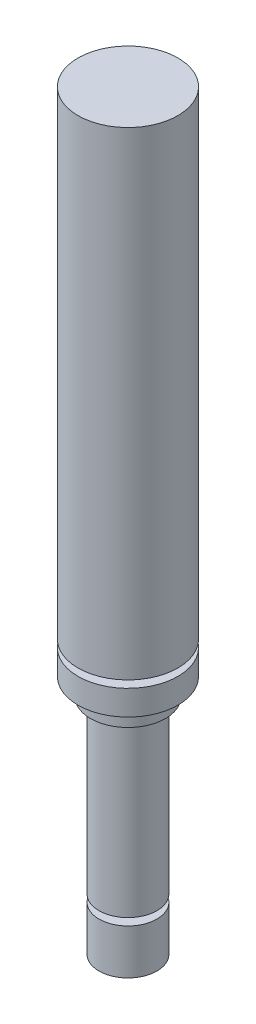
ISO-10303-21;
HEADER;
FILE_DESCRIPTION(('STEP AP214'),'2;1');
FILE_NAME('part.step','',(''),(''),'','','');
FILE_SCHEMA(('AUTOMOTIVE_DESIGN { 1 0 10303 214 1 1 1 1 }'));
ENDSEC;
DATA;
#1=APPLICATION_CONTEXT('core data for automotive mechanical design processes');
#2=APPLICATION_PROTOCOL_DEFINITION('international standard','automotive_design',2000,#1);
#3=PRODUCT_CONTEXT('',#1,'mechanical');
#4=PRODUCT('Part','Part','',(#3));
#5=PRODUCT_RELATED_PRODUCT_CATEGORY('part','',(#4));
#6=PRODUCT_DEFINITION_FORMATION('','',#4);
#7=PRODUCT_DEFINITION_CONTEXT('part definition',#1,'design');
#8=PRODUCT_DEFINITION('design','',#6,#7);
#9=PRODUCT_DEFINITION_SHAPE('','',#8);
#10=(LENGTH_UNIT() NAMED_UNIT(*) SI_UNIT(.MILLI.,.METRE.));
#11=(NAMED_UNIT(*) PLANE_ANGLE_UNIT() SI_UNIT($,.RADIAN.));
#12=(NAMED_UNIT(*) SI_UNIT($,.STERADIAN.) SOLID_ANGLE_UNIT());
#13=UNCERTAINTY_MEASURE_WITH_UNIT(LENGTH_MEASURE(1.E-05),#10,'distance_accuracy_value','');
#14=(GEOMETRIC_REPRESENTATION_CONTEXT(3) GLOBAL_UNCERTAINTY_ASSIGNED_CONTEXT((#13)) GLOBAL_UNIT_ASSIGNED_CONTEXT((#10,
#11,#12)) REPRESENTATION_CONTEXT('',''));
#15=CARTESIAN_POINT('',(0.,0.,0.));
#16=DIRECTION('',(0.,0.,1.));
#17=DIRECTION('',(1.,0.,0.));
#18=AXIS2_PLACEMENT_3D('',#15,#16,#17);
#19=CARTESIAN_POINT('',(0.,0.,0.));
#20=DIRECTION('',(0.,1.,0.));
#21=DIRECTION('',(0.,0.,1.));
#22=AXIS2_PLACEMENT_3D('',#19,#20,#21);
#23=PLANE('',#22);
#24=CARTESIAN_POINT('',(0.,0.,0.));
#25=DIRECTION('',(0.,1.,0.));
#26=DIRECTION('',(0.,0.,1.));
#27=AXIS2_PLACEMENT_3D('',#24,#25,#26);
#28=CIRCLE('',#27,2.);
#29=CARTESIAN_POINT('',(0.,0.,2.));
#30=VERTEX_POINT('',#29);
#31=EDGE_CURVE('E10',#30,#30,#28,.T.);
#32=ORIENTED_EDGE('',*,*,#31,.F.);
#33=EDGE_LOOP('',(#32));
#34=FACE_BOUND('',#33,.T.);
#35=ADVANCED_FACE('F37',(#34),#23,.F.);
#36=CARTESIAN_POINT('',(0.,8.45250000000001,0.));
#37=DIRECTION('',(0.,1.,0.));
#38=DIRECTION('',(0.,0.,1.));
#39=AXIS2_PLACEMENT_3D('',#36,#37,#38);
#40=CYLINDRICAL_SURFACE('',#39,2.);
#41=CARTESIAN_POINT('',(0.,3.11166019546219,0.));
#42=DIRECTION('',(0.,1.,0.));
#43=DIRECTION('',(0.,0.,1.));
#44=AXIS2_PLACEMENT_3D('',#41,#42,#43);
#45=CIRCLE('',#44,2.);
#46=CARTESIAN_POINT('',(0.,3.11166019546219,2.));
#47=VERTEX_POINT('',#46);
#48=EDGE_CURVE('E44',#47,#47,#45,.T.);
#49=ORIENTED_EDGE('',*,*,#48,.F.);
#50=EDGE_LOOP('',(#49));
#51=FACE_BOUND('',#50,.T.);
#52=ORIENTED_EDGE('',*,*,#31,.T.);
#53=EDGE_LOOP('',(#52));
#54=FACE_BOUND('',#53,.T.);
#55=ADVANCED_FACE('F171',(#51,#54),#40,.T.);
#56=CARTESIAN_POINT('',(2.,3.11166019546218,0.));
#57=DIRECTION('',(0.,-1.,0.));
#58=DIRECTION('',(0.,0.,-1.));
#59=AXIS2_PLACEMENT_3D('',#56,#57,#58);
#60=PLANE('',#59);
#61=CARTESIAN_POINT('',(0.,3.11166019546218,0.));
#62=DIRECTION('',(0.,1.,0.));
#63=DIRECTION('',(0.,0.,1.));
#64=AXIS2_PLACEMENT_3D('',#61,#62,#63);
#65=CIRCLE('',#64,1.29932784948275);
#66=CARTESIAN_POINT('',(0.,3.11166019546218,1.29932784948275));
#67=VERTEX_POINT('',#66);
#68=EDGE_CURVE('E49',#67,#67,#65,.T.);
#69=ORIENTED_EDGE('',*,*,#68,.F.);
#70=EDGE_LOOP('',(#69));
#71=FACE_BOUND('',#70,.T.);
#72=ORIENTED_EDGE('',*,*,#48,.T.);
#73=EDGE_LOOP('',(#72));
#74=FACE_BOUND('',#73,.T.);
#75=ADVANCED_FACE('F166',(#71,#74),#60,.F.);
#76=CARTESIAN_POINT('',(0.,8.45250000000001,0.));
#77=DIRECTION('',(0.,1.,0.));
#78=DIRECTION('',(0.,0.,1.));
#79=AXIS2_PLACEMENT_3D('',#76,#77,#78);
#80=CYLINDRICAL_SURFACE('',#79,1.29932784948275);
#81=CARTESIAN_POINT('',(0.,3.61166019546218,0.));
#82=DIRECTION('',(0.,1.,0.));
#83=DIRECTION('',(0.,0.,1.));
#84=AXIS2_PLACEMENT_3D('',#81,#82,#83);
#85=CIRCLE('',#84,1.29932784948275);
#86=CARTESIAN_POINT('',(0.,3.61166019546218,1.29932784948275));
#87=VERTEX_POINT('',#86);
#88=EDGE_CURVE('E54',#87,#87,#85,.T.);
#89=ORIENTED_EDGE('',*,*,#88,.F.);
#90=EDGE_LOOP('',(#89));
#91=FACE_BOUND('',#90,.T.);
#92=ORIENTED_EDGE('',*,*,#68,.T.);
#93=EDGE_LOOP('',(#92));
#94=FACE_BOUND('',#93,.T.);
#95=ADVANCED_FACE('F160',(#91,#94),#80,.T.);
#96=CARTESIAN_POINT('',(1.29932784948275,3.61166019546218,0.));
#97=DIRECTION('',(0.,1.,0.));
#98=DIRECTION('',(0.,0.,1.));
#99=AXIS2_PLACEMENT_3D('',#96,#97,#98);
#100=PLANE('',#99);
#101=CARTESIAN_POINT('',(0.,3.61166019546218,0.));
#102=DIRECTION('',(0.,1.,0.));
#103=DIRECTION('',(0.,0.,1.));
#104=AXIS2_PLACEMENT_3D('',#101,#102,#103);
#105=CIRCLE('',#104,2.);
#106=CARTESIAN_POINT('',(0.,3.61166019546218,2.));
#107=VERTEX_POINT('',#106);
#108=EDGE_CURVE('E60',#107,#107,#105,.T.);
#109=ORIENTED_EDGE('',*,*,#108,.F.);
#110=EDGE_LOOP('',(#109));
#111=FACE_BOUND('',#110,.T.);
#112=ORIENTED_EDGE('',*,*,#88,.T.);
#113=EDGE_LOOP('',(#112));
#114=FACE_BOUND('',#113,.T.);
#115=ADVANCED_FACE('F154',(#111,#114),#100,.F.);
#116=CARTESIAN_POINT('',(0.,8.45250000000001,0.));
#117=DIRECTION('',(0.,1.,0.));
#118=DIRECTION('',(0.,0.,1.));
#119=AXIS2_PLACEMENT_3D('',#116,#117,#118);
#120=CYLINDRICAL_SURFACE('',#119,2.);
#121=CARTESIAN_POINT('',(0.,15.4,0.));
#122=DIRECTION('',(0.,1.,0.));
#123=DIRECTION('',(0.,0.,1.));
#124=AXIS2_PLACEMENT_3D('',#121,#122,#123);
#125=CIRCLE('',#124,2.);
#126=CARTESIAN_POINT('',(0.,15.4,2.));
#127=VERTEX_POINT('',#126);
#128=EDGE_CURVE('E64',#127,#127,#125,.T.);
#129=ORIENTED_EDGE('',*,*,#128,.F.);
#130=EDGE_LOOP('',(#129));
#131=FACE_BOUND('',#130,.T.);
#132=ORIENTED_EDGE('',*,*,#108,.T.);
#133=EDGE_LOOP('',(#132));
#134=FACE_BOUND('',#133,.T.);
#135=ADVANCED_FACE('F148',(#131,#134),#120,.T.);
#136=CARTESIAN_POINT('',(2.,15.4,0.));
#137=DIRECTION('',(0.,1.,0.));
#138=DIRECTION('',(0.,0.,1.));
#139=AXIS2_PLACEMENT_3D('',#136,#137,#138);
#140=PLANE('',#139);
#141=CARTESIAN_POINT('',(0.,15.4,0.));
#142=DIRECTION('',(0.,1.,0.));
#143=DIRECTION('',(0.,0.,1.));
#144=AXIS2_PLACEMENT_3D('',#141,#142,#143);
#145=CIRCLE('',#144,2.5875);
#146=CARTESIAN_POINT('',(0.,15.4,2.5875));
#147=VERTEX_POINT('',#146);
#148=EDGE_CURVE('E68',#147,#147,#145,.T.);
#149=ORIENTED_EDGE('',*,*,#148,.F.);
#150=EDGE_LOOP('',(#149));
#151=FACE_BOUND('',#150,.T.);
#152=ORIENTED_EDGE('',*,*,#128,.T.);
#153=EDGE_LOOP('',(#152));
#154=FACE_BOUND('',#153,.T.);
#155=ADVANCED_FACE('F142',(#151,#154),#140,.F.);
#156=CARTESIAN_POINT('',(0.,8.45250000000001,0.));
#157=DIRECTION('',(0.,1.,0.));
#158=DIRECTION('',(0.,0.,1.));
#159=AXIS2_PLACEMENT_3D('',#156,#157,#158);
#160=CYLINDRICAL_SURFACE('',#159,2.5875);
#161=CARTESIAN_POINT('',(0.,16.6321428571429,0.));
#162=DIRECTION('',(0.,1.,0.));
#163=DIRECTION('',(0.,0.,1.));
#164=AXIS2_PLACEMENT_3D('',#161,#162,#163);
#165=CIRCLE('',#164,2.5875);
#166=CARTESIAN_POINT('',(0.,16.6321428571429,2.5875));
#167=VERTEX_POINT('',#166);
#168=EDGE_CURVE('E72',#167,#167,#165,.T.);
#169=ORIENTED_EDGE('',*,*,#168,.F.);
#170=EDGE_LOOP('',(#169));
#171=FACE_BOUND('',#170,.T.);
#172=ORIENTED_EDGE('',*,*,#148,.T.);
#173=EDGE_LOOP('',(#172));
#174=FACE_BOUND('',#173,.T.);
#175=ADVANCED_FACE('F136',(#171,#174),#160,.T.);
#176=CARTESIAN_POINT('',(2.5875,16.6321428571429,0.));
#177=DIRECTION('',(0.,1.,0.));
#178=DIRECTION('',(0.,0.,1.));
#179=AXIS2_PLACEMENT_3D('',#176,#177,#178);
#180=PLANE('',#179);
#181=CARTESIAN_POINT('',(0.,16.6321428571429,0.));
#182=DIRECTION('',(0.,1.,0.));
#183=DIRECTION('',(0.,0.,1.));
#184=AXIS2_PLACEMENT_3D('',#181,#182,#183);
#185=CIRCLE('',#184,3.45);
#186=CARTESIAN_POINT('',(0.,16.6321428571429,3.45));
#187=VERTEX_POINT('',#186);
#188=EDGE_CURVE('E76',#187,#187,#185,.T.);
#189=ORIENTED_EDGE('',*,*,#188,.F.);
#190=EDGE_LOOP('',(#189));
#191=FACE_BOUND('',#190,.T.);
#192=ORIENTED_EDGE('',*,*,#168,.T.);
#193=EDGE_LOOP('',(#192));
#194=FACE_BOUND('',#193,.T.);
#195=ADVANCED_FACE('F130',(#191,#194),#180,.F.);
#196=CARTESIAN_POINT('',(0.,8.45250000000001,0.));
#197=DIRECTION('',(0.,1.,0.));
#198=DIRECTION('',(0.,0.,1.));
#199=AXIS2_PLACEMENT_3D('',#196,#197,#198);
#200=CYLINDRICAL_SURFACE('',#199,3.45);
#201=CARTESIAN_POINT('',(0.,18.3549347164202,0.));
#202=DIRECTION('',(0.,1.,0.));
#203=DIRECTION('',(0.,0.,1.));
#204=AXIS2_PLACEMENT_3D('',#201,#202,#203);
#205=CIRCLE('',#204,3.45);
#206=CARTESIAN_POINT('',(0.,18.3549347164202,3.45));
#207=VERTEX_POINT('',#206);
#208=EDGE_CURVE('E80',#207,#207,#205,.T.);
#209=ORIENTED_EDGE('',*,*,#208,.F.);
#210=EDGE_LOOP('',(#209));
#211=FACE_BOUND('',#210,.T.);
#212=ORIENTED_EDGE('',*,*,#188,.T.);
#213=EDGE_LOOP('',(#212));
#214=FACE_BOUND('',#213,.T.);
#215=ADVANCED_FACE('F124',(#211,#214),#200,.T.);
#216=CARTESIAN_POINT('',(3.45,18.3549347164202,0.));
#217=DIRECTION('',(0.,-1.,0.));
#218=DIRECTION('',(0.,0.,-1.));
#219=AXIS2_PLACEMENT_3D('',#216,#217,#218);
#220=PLANE('',#219);
#221=CARTESIAN_POINT('',(0.,18.3549347164202,0.));
#222=DIRECTION('',(0.,1.,0.));
#223=DIRECTION('',(0.,0.,1.));
#224=AXIS2_PLACEMENT_3D('',#221,#222,#223);
#225=CIRCLE('',#224,2.5875);
#226=CARTESIAN_POINT('',(0.,18.3549347164202,2.5875));
#227=VERTEX_POINT('',#226);
#228=EDGE_CURVE('E84',#227,#227,#225,.T.);
#229=ORIENTED_EDGE('',*,*,#228,.F.);
#230=EDGE_LOOP('',(#229));
#231=FACE_BOUND('',#230,.T.);
#232=ORIENTED_EDGE('',*,*,#208,.T.);
#233=EDGE_LOOP('',(#232));
#234=FACE_BOUND('',#233,.T.);
#235=ADVANCED_FACE('F118',(#231,#234),#220,.F.);
#236=CARTESIAN_POINT('',(0.,8.45250000000001,0.));
#237=DIRECTION('',(0.,1.,0.));
#238=DIRECTION('',(0.,0.,1.));
#239=AXIS2_PLACEMENT_3D('',#236,#237,#238);
#240=CYLINDRICAL_SURFACE('',#239,2.5875);
#241=CARTESIAN_POINT('',(0.,18.8549347164202,0.));
#242=DIRECTION('',(0.,1.,0.));
#243=DIRECTION('',(0.,0.,1.));
#244=AXIS2_PLACEMENT_3D('',#241,#242,#243);
#245=CIRCLE('',#244,2.5875);
#246=CARTESIAN_POINT('',(0.,18.8549347164202,2.5875));
#247=VERTEX_POINT('',#246);
#248=EDGE_CURVE('E88',#247,#247,#245,.T.);
#249=ORIENTED_EDGE('',*,*,#248,.F.);
#250=EDGE_LOOP('',(#249));
#251=FACE_BOUND('',#250,.T.);
#252=ORIENTED_EDGE('',*,*,#228,.T.);
#253=EDGE_LOOP('',(#252));
#254=FACE_BOUND('',#253,.T.);
#255=ADVANCED_FACE('F112',(#251,#254),#240,.T.);
#256=CARTESIAN_POINT('',(2.5875,18.8549347164202,0.));
#257=DIRECTION('',(0.,1.,0.));
#258=DIRECTION('',(0.,0.,1.));
#259=AXIS2_PLACEMENT_3D('',#256,#257,#258);
#260=PLANE('',#259);
#261=CARTESIAN_POINT('',(0.,18.8549347164202,0.));
#262=DIRECTION('',(0.,1.,0.));
#263=DIRECTION('',(0.,0.,1.));
#264=AXIS2_PLACEMENT_3D('',#261,#262,#263);
#265=CIRCLE('',#264,3.45);
#266=CARTESIAN_POINT('',(0.,18.8549347164202,3.45));
#267=VERTEX_POINT('',#266);
#268=EDGE_CURVE('E92',#267,#267,#265,.T.);
#269=ORIENTED_EDGE('',*,*,#268,.F.);
#270=EDGE_LOOP('',(#269));
#271=FACE_BOUND('',#270,.T.);
#272=ORIENTED_EDGE('',*,*,#248,.T.);
#273=EDGE_LOOP('',(#272));
#274=FACE_BOUND('',#273,.T.);
#275=ADVANCED_FACE('F106',(#271,#274),#260,.F.);
#276=CARTESIAN_POINT('',(0.,8.45250000000001,0.));
#277=DIRECTION('',(0.,1.,0.));
#278=DIRECTION('',(0.,0.,1.));
#279=AXIS2_PLACEMENT_3D('',#276,#277,#278);
#280=CYLINDRICAL_SURFACE('',#279,3.45);
#281=CARTESIAN_POINT('',(0.,51.9,0.));
#282=DIRECTION('',(0.,1.,0.));
#283=DIRECTION('',(0.,0.,1.));
#284=AXIS2_PLACEMENT_3D('',#281,#282,#283);
#285=CIRCLE('',#284,3.45);
#286=CARTESIAN_POINT('',(0.,51.9,3.45));
#287=VERTEX_POINT('',#286);
#288=EDGE_CURVE('E96',#287,#287,#285,.T.);
#289=ORIENTED_EDGE('',*,*,#288,.F.);
#290=EDGE_LOOP('',(#289));
#291=FACE_BOUND('',#290,.T.);
#292=ORIENTED_EDGE('',*,*,#268,.T.);
#293=EDGE_LOOP('',(#292));
#294=FACE_BOUND('',#293,.T.);
#295=ADVANCED_FACE('F103',(#291,#294),#280,.T.);
#296=CARTESIAN_POINT('',(3.45,51.9,0.));
#297=DIRECTION('',(0.,-1.,0.));
#298=DIRECTION('',(0.,0.,-1.));
#299=AXIS2_PLACEMENT_3D('',#296,#297,#298);
#300=PLANE('',#299);
#301=ORIENTED_EDGE('',*,*,#288,.T.);
#302=EDGE_LOOP('',(#301));
#303=FACE_BOUND('',#302,.T.);
#304=ADVANCED_FACE('F101',(#303),#300,.F.);
#305=CLOSED_SHELL('',(#35,#55,#75,#95,#115,#135,#155,#175,#195,#215,#235,#255,#275,#295,#304));
#306=MANIFOLD_SOLID_BREP('B2',#305);
#307=ADVANCED_BREP_SHAPE_REPRESENTATION('',(#18,#306),#14);
#308=SHAPE_DEFINITION_REPRESENTATION(#9,#307);
ENDSEC;
END-ISO-10303-21;
